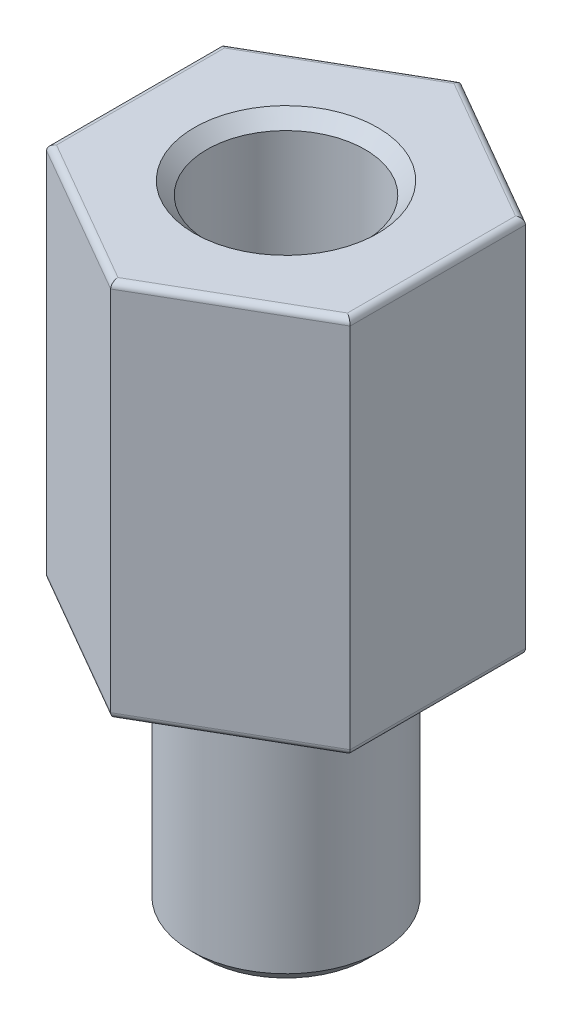
ISO-10303-21;
HEADER;
FILE_DESCRIPTION(('STEP AP214'),'2;1');
FILE_NAME('part.step','',(''),(''),'','','');
FILE_SCHEMA(('AUTOMOTIVE_DESIGN { 1 0 10303 214 1 1 1 1 }'));
ENDSEC;
DATA;
#1=APPLICATION_CONTEXT('core data for automotive mechanical design processes');
#2=APPLICATION_PROTOCOL_DEFINITION('international standard','automotive_design',2000,#1);
#3=PRODUCT_CONTEXT('',#1,'mechanical');
#4=PRODUCT('Part','Part','',(#3));
#5=PRODUCT_RELATED_PRODUCT_CATEGORY('part','',(#4));
#6=PRODUCT_DEFINITION_FORMATION('','',#4);
#7=PRODUCT_DEFINITION_CONTEXT('part definition',#1,'design');
#8=PRODUCT_DEFINITION('design','',#6,#7);
#9=PRODUCT_DEFINITION_SHAPE('','',#8);
#10=(LENGTH_UNIT() NAMED_UNIT(*) SI_UNIT(.MILLI.,.METRE.));
#11=(NAMED_UNIT(*) PLANE_ANGLE_UNIT() SI_UNIT($,.RADIAN.));
#12=(NAMED_UNIT(*) SI_UNIT($,.STERADIAN.) SOLID_ANGLE_UNIT());
#13=UNCERTAINTY_MEASURE_WITH_UNIT(LENGTH_MEASURE(1.E-05),#10,'distance_accuracy_value','');
#14=(GEOMETRIC_REPRESENTATION_CONTEXT(3) GLOBAL_UNCERTAINTY_ASSIGNED_CONTEXT((#13)) GLOBAL_UNIT_ASSIGNED_CONTEXT((#10,
#11,#12)) REPRESENTATION_CONTEXT('',''));
#15=CARTESIAN_POINT('',(0.,0.,0.));
#16=DIRECTION('',(0.,0.,1.));
#17=DIRECTION('',(1.,0.,0.));
#18=AXIS2_PLACEMENT_3D('',#15,#16,#17);
#19=CARTESIAN_POINT('',(0.,4.,0.));
#20=DIRECTION('',(0.,-1.,0.));
#21=DIRECTION('',(0.,0.,-1.));
#22=AXIS2_PLACEMENT_3D('',#19,#20,#21);
#23=CYLINDRICAL_SURFACE('',#22,1.5);
#24=CARTESIAN_POINT('',(0.,0.2,0.));
#25=DIRECTION('',(0.,1.,0.));
#26=DIRECTION('',(0.,0.,1.));
#27=AXIS2_PLACEMENT_3D('',#24,#25,#26);
#28=CIRCLE('',#27,1.5);
#29=CARTESIAN_POINT('',(0.,0.2,1.5));
#30=VERTEX_POINT('',#29);
#31=EDGE_CURVE('E217',#30,#30,#28,.T.);
#32=ORIENTED_EDGE('',*,*,#31,.T.);
#33=EDGE_LOOP('',(#32));
#34=FACE_BOUND('',#33,.T.);
#35=CARTESIAN_POINT('',(0.,4.,0.));
#36=DIRECTION('',(0.,1.,0.));
#37=DIRECTION('',(0.,0.,1.));
#38=AXIS2_PLACEMENT_3D('',#35,#36,#37);
#39=CIRCLE('',#38,1.5);
#40=CARTESIAN_POINT('',(0.,4.,1.5));
#41=VERTEX_POINT('',#40);
#42=EDGE_CURVE('E164',#41,#41,#39,.T.);
#43=ORIENTED_EDGE('',*,*,#42,.F.);
#44=EDGE_LOOP('',(#43));
#45=FACE_BOUND('',#44,.T.);
#46=ADVANCED_FACE('F39',(#34,#45),#23,.T.);
#47=CARTESIAN_POINT('',(0.,0.,0.));
#48=DIRECTION('',(0.,1.,0.));
#49=DIRECTION('',(0.,0.,1.));
#50=AXIS2_PLACEMENT_3D('',#47,#48,#49);
#51=PLANE('',#50);
#52=CARTESIAN_POINT('',(0.,0.,0.));
#53=DIRECTION('',(0.,1.,0.));
#54=DIRECTION('',(0.,0.,1.));
#55=AXIS2_PLACEMENT_3D('',#52,#53,#54);
#56=CIRCLE('',#55,1.3);
#57=CARTESIAN_POINT('',(0.,0.,1.3));
#58=VERTEX_POINT('',#57);
#59=EDGE_CURVE('E248',#58,#58,#56,.F.);
#60=ORIENTED_EDGE('',*,*,#59,.T.);
#61=EDGE_LOOP('',(#60));
#62=FACE_BOUND('',#61,.T.);
#63=ADVANCED_FACE('F263',(#62),#51,.F.);
#64=CARTESIAN_POINT('',(0.,4.,0.));
#65=DIRECTION('',(0.,1.,0.));
#66=DIRECTION('',(0.,0.,1.));
#67=AXIS2_PLACEMENT_3D('',#64,#65,#66);
#68=PLANE('',#67);
#69=DIRECTION('',(-0.866025403784439,0.,-0.5));
#70=VECTOR('',#69,1.);
#71=CARTESIAN_POINT('',(1.15,4.,-1.99185842870421));
#72=LINE('',#71,#70);
#73=CARTESIAN_POINT('',(0.,4.,-2.65581123827228));
#74=VERTEX_POINT('',#73);
#75=CARTESIAN_POINT('',(2.3,4.,-1.32790561913614));
#76=VERTEX_POINT('',#75);
#77=EDGE_CURVE('E172',#74,#76,#72,.F.);
#78=ORIENTED_EDGE('',*,*,#77,.T.);
#79=DIRECTION('',(0.,0.,-1.));
#80=VECTOR('',#79,1.);
#81=CARTESIAN_POINT('',(2.3,4.,0.));
#82=LINE('',#81,#80);
#83=CARTESIAN_POINT('',(2.3,4.,1.32790561913614));
#84=VERTEX_POINT('',#83);
#85=EDGE_CURVE('E182',#76,#84,#82,.F.);
#86=ORIENTED_EDGE('',*,*,#85,.T.);
#87=DIRECTION('',(0.866025403784438,0.,-0.5));
#88=VECTOR('',#87,1.);
#89=CARTESIAN_POINT('',(1.15,4.,1.99185842870421));
#90=LINE('',#89,#88);
#91=CARTESIAN_POINT('',(0.,4.,2.65581123827228));
#92=VERTEX_POINT('',#91);
#93=EDGE_CURVE('E180',#84,#92,#90,.F.);
#94=ORIENTED_EDGE('',*,*,#93,.T.);
#95=DIRECTION('',(0.866025403784439,0.,0.5));
#96=VECTOR('',#95,1.);
#97=CARTESIAN_POINT('',(-1.15,4.,1.99185842870421));
#98=LINE('',#97,#96);
#99=CARTESIAN_POINT('',(-2.3,4.,1.32790561913614));
#100=VERTEX_POINT('',#99);
#101=EDGE_CURVE('E178',#92,#100,#98,.F.);
#102=ORIENTED_EDGE('',*,*,#101,.T.);
#103=DIRECTION('',(0.,0.,1.));
#104=VECTOR('',#103,1.);
#105=CARTESIAN_POINT('',(-2.3,4.,0.));
#106=LINE('',#105,#104);
#107=CARTESIAN_POINT('',(-2.3,4.,-1.32790561913614));
#108=VERTEX_POINT('',#107);
#109=EDGE_CURVE('E176',#100,#108,#106,.F.);
#110=ORIENTED_EDGE('',*,*,#109,.T.);
#111=DIRECTION('',(-0.866025403784439,0.,0.5));
#112=VECTOR('',#111,1.);
#113=CARTESIAN_POINT('',(-1.15,4.,-1.99185842870421));
#114=LINE('',#113,#112);
#115=EDGE_CURVE('E174',#108,#74,#114,.F.);
#116=ORIENTED_EDGE('',*,*,#115,.T.);
#117=EDGE_LOOP('',(#78,#86,#94,#102,#110,#116));
#118=FACE_BOUND('',#117,.T.);
#119=ORIENTED_EDGE('',*,*,#42,.T.);
#120=EDGE_LOOP('',(#119));
#121=FACE_BOUND('',#120,.T.);
#122=ADVANCED_FACE('F269',(#118,#121),#68,.F.);
#123=CARTESIAN_POINT('',(0.,10.,-2.7712812921102));
#124=DIRECTION('',(0.5,0.,0.866025403784439));
#125=DIRECTION('',(0.866025403784439,0.,-0.5));
#126=AXIS2_PLACEMENT_3D('',#123,#124,#125);
#127=PLANE('',#126);
#128=DIRECTION('',(0.,-1.,0.));
#129=VECTOR('',#128,1.);
#130=CARTESIAN_POINT('',(0.,10.,-2.7712812921102));
#131=LINE('',#130,#129);
#132=CARTESIAN_POINT('',(0.,9.9,-2.7712812921102));
#133=VERTEX_POINT('',#132);
#134=CARTESIAN_POINT('',(0.,4.1,-2.7712812921102));
#135=VERTEX_POINT('',#134);
#136=EDGE_CURVE('E145',#133,#135,#131,.T.);
#137=ORIENTED_EDGE('',*,*,#136,.T.);
#138=DIRECTION('',(-0.866025403784439,0.,0.5));
#139=VECTOR('',#138,1.);
#140=CARTESIAN_POINT('',(0.,4.1,-2.7712812921102));
#141=LINE('',#140,#139);
#142=CARTESIAN_POINT('',(-2.4,4.1,-1.3856406460551));
#143=VERTEX_POINT('',#142);
#144=EDGE_CURVE('E200',#135,#143,#141,.T.);
#145=ORIENTED_EDGE('',*,*,#144,.T.);
#146=DIRECTION('',(0.,-1.,0.));
#147=VECTOR('',#146,1.);
#148=CARTESIAN_POINT('',(-2.4,10.,-1.3856406460551));
#149=LINE('',#148,#147);
#150=CARTESIAN_POINT('',(-2.4,9.9,-1.3856406460551));
#151=VERTEX_POINT('',#150);
#152=EDGE_CURVE('E161',#151,#143,#149,.T.);
#153=ORIENTED_EDGE('',*,*,#152,.F.);
#154=DIRECTION('',(-0.866025403784439,0.,0.5));
#155=VECTOR('',#154,1.);
#156=CARTESIAN_POINT('',(0.,9.9,-2.7712812921102));
#157=LINE('',#156,#155);
#158=EDGE_CURVE('E197',#151,#133,#157,.F.);
#159=ORIENTED_EDGE('',*,*,#158,.T.);
#160=EDGE_LOOP('',(#137,#145,#153,#159));
#161=FACE_BOUND('',#160,.T.);
#162=ADVANCED_FACE('F368',(#161),#127,.F.);
#163=CARTESIAN_POINT('',(-2.4,10.,-1.3856406460551));
#164=DIRECTION('',(1.,0.,0.));
#165=DIRECTION('',(0.,0.,-1.));
#166=AXIS2_PLACEMENT_3D('',#163,#164,#165);
#167=PLANE('',#166);
#168=ORIENTED_EDGE('',*,*,#152,.T.);
#169=DIRECTION('',(0.,0.,1.));
#170=VECTOR('',#169,1.);
#171=CARTESIAN_POINT('',(-2.4,4.1,-1.3856406460551));
#172=LINE('',#171,#170);
#173=CARTESIAN_POINT('',(-2.4,4.1,1.3856406460551));
#174=VERTEX_POINT('',#173);
#175=EDGE_CURVE('E195',#143,#174,#172,.T.);
#176=ORIENTED_EDGE('',*,*,#175,.T.);
#177=DIRECTION('',(0.,-1.,0.));
#178=VECTOR('',#177,1.);
#179=CARTESIAN_POINT('',(-2.4,10.,1.3856406460551));
#180=LINE('',#179,#178);
#181=CARTESIAN_POINT('',(-2.4,9.9,1.3856406460551));
#182=VERTEX_POINT('',#181);
#183=EDGE_CURVE('E158',#182,#174,#180,.T.);
#184=ORIENTED_EDGE('',*,*,#183,.F.);
#185=DIRECTION('',(0.,0.,1.));
#186=VECTOR('',#185,1.);
#187=CARTESIAN_POINT('',(-2.4,9.9,-1.3856406460551));
#188=LINE('',#187,#186);
#189=EDGE_CURVE('E193',#182,#151,#188,.F.);
#190=ORIENTED_EDGE('',*,*,#189,.T.);
#191=EDGE_LOOP('',(#168,#176,#184,#190));
#192=FACE_BOUND('',#191,.T.);
#193=ADVANCED_FACE('F336',(#192),#167,.F.);
#194=CARTESIAN_POINT('',(-2.4,10.,1.3856406460551));
#195=DIRECTION('',(0.5,0.,-0.866025403784439));
#196=DIRECTION('',(-0.866025403784439,0.,-0.5));
#197=AXIS2_PLACEMENT_3D('',#194,#195,#196);
#198=PLANE('',#197);
#199=ORIENTED_EDGE('',*,*,#183,.T.);
#200=DIRECTION('',(0.866025403784439,0.,0.5));
#201=VECTOR('',#200,1.);
#202=CARTESIAN_POINT('',(-2.4,4.1,1.3856406460551));
#203=LINE('',#202,#201);
#204=CARTESIAN_POINT('',(0.,4.1,2.7712812921102));
#205=VERTEX_POINT('',#204);
#206=EDGE_CURVE('E191',#174,#205,#203,.T.);
#207=ORIENTED_EDGE('',*,*,#206,.T.);
#208=DIRECTION('',(0.,-1.,0.));
#209=VECTOR('',#208,1.);
#210=CARTESIAN_POINT('',(0.,10.,2.7712812921102));
#211=LINE('',#210,#209);
#212=CARTESIAN_POINT('',(0.,9.9,2.7712812921102));
#213=VERTEX_POINT('',#212);
#214=EDGE_CURVE('E155',#213,#205,#211,.T.);
#215=ORIENTED_EDGE('',*,*,#214,.F.);
#216=DIRECTION('',(0.866025403784439,0.,0.5));
#217=VECTOR('',#216,1.);
#218=CARTESIAN_POINT('',(-2.4,9.9,1.3856406460551));
#219=LINE('',#218,#217);
#220=EDGE_CURVE('E189',#213,#182,#219,.F.);
#221=ORIENTED_EDGE('',*,*,#220,.T.);
#222=EDGE_LOOP('',(#199,#207,#215,#221));
#223=FACE_BOUND('',#222,.T.);
#224=ADVANCED_FACE('F333',(#223),#198,.F.);
#225=CARTESIAN_POINT('',(0.,10.,2.7712812921102));
#226=DIRECTION('',(-0.5,0.,-0.866025403784438));
#227=DIRECTION('',(-0.866025403784438,0.,0.5));
#228=AXIS2_PLACEMENT_3D('',#225,#226,#227);
#229=PLANE('',#228);
#230=ORIENTED_EDGE('',*,*,#214,.T.);
#231=DIRECTION('',(0.866025403784438,0.,-0.5));
#232=VECTOR('',#231,1.);
#233=CARTESIAN_POINT('',(0.,4.1,2.7712812921102));
#234=LINE('',#233,#232);
#235=CARTESIAN_POINT('',(2.4,4.1,1.3856406460551));
#236=VERTEX_POINT('',#235);
#237=EDGE_CURVE('E187',#205,#236,#234,.T.);
#238=ORIENTED_EDGE('',*,*,#237,.T.);
#239=DIRECTION('',(0.,-1.,0.));
#240=VECTOR('',#239,1.);
#241=CARTESIAN_POINT('',(2.4,10.,1.3856406460551));
#242=LINE('',#241,#240);
#243=CARTESIAN_POINT('',(2.4,9.9,1.3856406460551));
#244=VERTEX_POINT('',#243);
#245=EDGE_CURVE('E152',#244,#236,#242,.T.);
#246=ORIENTED_EDGE('',*,*,#245,.F.);
#247=DIRECTION('',(0.866025403784438,0.,-0.5));
#248=VECTOR('',#247,1.);
#249=CARTESIAN_POINT('',(0.,9.9,2.7712812921102));
#250=LINE('',#249,#248);
#251=EDGE_CURVE('E185',#244,#213,#250,.F.);
#252=ORIENTED_EDGE('',*,*,#251,.T.);
#253=EDGE_LOOP('',(#230,#238,#246,#252));
#254=FACE_BOUND('',#253,.T.);
#255=ADVANCED_FACE('F353',(#254),#229,.F.);
#256=CARTESIAN_POINT('',(2.4,10.,1.3856406460551));
#257=DIRECTION('',(-1.,0.,0.));
#258=DIRECTION('',(0.,0.,1.));
#259=AXIS2_PLACEMENT_3D('',#256,#257,#258);
#260=PLANE('',#259);
#261=ORIENTED_EDGE('',*,*,#245,.T.);
#262=DIRECTION('',(0.,0.,-1.));
#263=VECTOR('',#262,1.);
#264=CARTESIAN_POINT('',(2.4,4.1,1.3856406460551));
#265=LINE('',#264,#263);
#266=CARTESIAN_POINT('',(2.4,4.1,-1.3856406460551));
#267=VERTEX_POINT('',#266);
#268=EDGE_CURVE('E169',#236,#267,#265,.T.);
#269=ORIENTED_EDGE('',*,*,#268,.T.);
#270=DIRECTION('',(0.,-1.,0.));
#271=VECTOR('',#270,1.);
#272=CARTESIAN_POINT('',(2.4,10.,-1.3856406460551));
#273=LINE('',#272,#271);
#274=CARTESIAN_POINT('',(2.4,9.9,-1.3856406460551));
#275=VERTEX_POINT('',#274);
#276=EDGE_CURVE('E148',#275,#267,#273,.T.);
#277=ORIENTED_EDGE('',*,*,#276,.F.);
#278=DIRECTION('',(0.,0.,-1.));
#279=VECTOR('',#278,1.);
#280=CARTESIAN_POINT('',(2.4,9.9,1.3856406460551));
#281=LINE('',#280,#279);
#282=EDGE_CURVE('E167',#275,#244,#281,.F.);
#283=ORIENTED_EDGE('',*,*,#282,.T.);
#284=EDGE_LOOP('',(#261,#269,#277,#283));
#285=FACE_BOUND('',#284,.T.);
#286=ADVANCED_FACE('F357',(#285),#260,.F.);
#287=CARTESIAN_POINT('',(2.4,10.,-1.3856406460551));
#288=DIRECTION('',(-0.5,0.,0.866025403784439));
#289=DIRECTION('',(0.866025403784439,0.,0.5));
#290=AXIS2_PLACEMENT_3D('',#287,#288,#289);
#291=PLANE('',#290);
#292=ORIENTED_EDGE('',*,*,#276,.T.);
#293=DIRECTION('',(-0.866025403784439,0.,-0.5));
#294=VECTOR('',#293,1.);
#295=CARTESIAN_POINT('',(2.4,4.1,-1.3856406460551));
#296=LINE('',#295,#294);
#297=EDGE_CURVE('E204',#267,#135,#296,.T.);
#298=ORIENTED_EDGE('',*,*,#297,.T.);
#299=ORIENTED_EDGE('',*,*,#136,.F.);
#300=DIRECTION('',(-0.866025403784439,0.,-0.5));
#301=VECTOR('',#300,1.);
#302=CARTESIAN_POINT('',(2.4,9.9,-1.3856406460551));
#303=LINE('',#302,#301);
#304=EDGE_CURVE('E202',#133,#275,#303,.F.);
#305=ORIENTED_EDGE('',*,*,#304,.T.);
#306=EDGE_LOOP('',(#292,#298,#299,#305));
#307=FACE_BOUND('',#306,.T.);
#308=ADVANCED_FACE('F366',(#307),#291,.F.);
#309=CARTESIAN_POINT('',(0.,10.,0.));
#310=DIRECTION('',(0.,1.,0.));
#311=DIRECTION('',(0.,0.,1.));
#312=AXIS2_PLACEMENT_3D('',#309,#310,#311);
#313=PLANE('',#312);
#314=CARTESIAN_POINT('',(0.,10.,0.));
#315=DIRECTION('',(0.,1.,0.));
#316=DIRECTION('',(0.,0.,1.));
#317=AXIS2_PLACEMENT_3D('',#314,#315,#316);
#318=CIRCLE('',#317,1.45);
#319=CARTESIAN_POINT('',(0.,10.,1.45));
#320=VERTEX_POINT('',#319);
#321=EDGE_CURVE('E11',#320,#320,#318,.F.);
#322=ORIENTED_EDGE('',*,*,#321,.T.);
#323=EDGE_LOOP('',(#322));
#324=FACE_BOUND('',#323,.T.);
#325=DIRECTION('',(-0.866025403784439,0.,-0.5));
#326=VECTOR('',#325,1.);
#327=CARTESIAN_POINT('',(-0.0500000000000006,10.,-2.68467875173176));
#328=LINE('',#327,#326);
#329=CARTESIAN_POINT('',(2.3,10.,-1.32790561913614));
#330=VERTEX_POINT('',#329);
#331=CARTESIAN_POINT('',(0.,10.,-2.65581123827228));
#332=VERTEX_POINT('',#331);
#333=EDGE_CURVE('E206',#330,#332,#328,.T.);
#334=ORIENTED_EDGE('',*,*,#333,.T.);
#335=DIRECTION('',(-0.866025403784439,0.,0.5));
#336=VECTOR('',#335,1.);
#337=CARTESIAN_POINT('',(-2.35,10.,-1.29903810567666));
#338=LINE('',#337,#336);
#339=CARTESIAN_POINT('',(-2.3,10.,-1.32790561913614));
#340=VERTEX_POINT('',#339);
#341=EDGE_CURVE('E215',#332,#340,#338,.T.);
#342=ORIENTED_EDGE('',*,*,#341,.T.);
#343=DIRECTION('',(0.,0.,1.));
#344=VECTOR('',#343,1.);
#345=CARTESIAN_POINT('',(-2.3,10.,1.3856406460551));
#346=LINE('',#345,#344);
#347=CARTESIAN_POINT('',(-2.3,10.,1.32790561913614));
#348=VERTEX_POINT('',#347);
#349=EDGE_CURVE('E61',#340,#348,#346,.T.);
#350=ORIENTED_EDGE('',*,*,#349,.T.);
#351=DIRECTION('',(0.866025403784439,0.,0.5));
#352=VECTOR('',#351,1.);
#353=CARTESIAN_POINT('',(0.0500000000000006,10.,2.68467875173176));
#354=LINE('',#353,#352);
#355=CARTESIAN_POINT('',(0.,10.,2.65581123827228));
#356=VERTEX_POINT('',#355);
#357=EDGE_CURVE('E212',#348,#356,#354,.T.);
#358=ORIENTED_EDGE('',*,*,#357,.T.);
#359=DIRECTION('',(0.866025403784438,0.,-0.5));
#360=VECTOR('',#359,1.);
#361=CARTESIAN_POINT('',(2.35,10.,1.29903810567666));
#362=LINE('',#361,#360);
#363=CARTESIAN_POINT('',(2.3,10.,1.32790561913614));
#364=VERTEX_POINT('',#363);
#365=EDGE_CURVE('E210',#356,#364,#362,.T.);
#366=ORIENTED_EDGE('',*,*,#365,.T.);
#367=DIRECTION('',(0.,0.,-1.));
#368=VECTOR('',#367,1.);
#369=CARTESIAN_POINT('',(2.3,10.,-1.3856406460551));
#370=LINE('',#369,#368);
#371=EDGE_CURVE('E208',#364,#330,#370,.T.);
#372=ORIENTED_EDGE('',*,*,#371,.T.);
#373=EDGE_LOOP('',(#334,#342,#350,#358,#366,#372));
#374=FACE_BOUND('',#373,.T.);
#375=ADVANCED_FACE('F299',(#324,#374),#313,.T.);
#376=CARTESIAN_POINT('',(-2.3,4.1,-1.3856406460551));
#377=DIRECTION('',(0.,0.,1.));
#378=DIRECTION('',(1.,0.,0.));
#379=AXIS2_PLACEMENT_3D('',#376,#377,#378);
#380=CYLINDRICAL_SURFACE('',#379,0.1);
#381=CARTESIAN_POINT('',(-2.3,4.1,-1.32790561913614));
#382=DIRECTION('',(-0.5,0.,0.866025403784439));
#383=DIRECTION('',(-0.866025403784439,0.,-0.5));
#384=AXIS2_PLACEMENT_3D('',#381,#382,#383);
#385=ELLIPSE('',#384,0.115470053837925,0.1);
#386=EDGE_CURVE('E229',#108,#143,#385,.F.);
#387=ORIENTED_EDGE('',*,*,#386,.F.);
#388=ORIENTED_EDGE('',*,*,#109,.F.);
#389=CARTESIAN_POINT('',(-2.3,4.1,1.32790561913614));
#390=DIRECTION('',(0.5,0.,0.866025403784439));
#391=DIRECTION('',(-0.866025403784439,0.,0.5));
#392=AXIS2_PLACEMENT_3D('',#389,#390,#391);
#393=ELLIPSE('',#392,0.115470053837925,0.1);
#394=EDGE_CURVE('E149',#174,#100,#393,.T.);
#395=ORIENTED_EDGE('',*,*,#394,.F.);
#396=ORIENTED_EDGE('',*,*,#175,.F.);
#397=EDGE_LOOP('',(#387,#388,#395,#396));
#398=FACE_BOUND('',#397,.T.);
#399=ADVANCED_FACE('F295',(#398),#380,.T.);
#400=CARTESIAN_POINT('',(-2.35,4.1,1.29903810567666));
#401=DIRECTION('',(0.866025403784439,0.,0.5));
#402=DIRECTION('',(0.5,0.,-0.866025403784439));
#403=AXIS2_PLACEMENT_3D('',#400,#401,#402);
#404=CYLINDRICAL_SURFACE('',#403,0.1);
#405=ORIENTED_EDGE('',*,*,#394,.T.);
#406=ORIENTED_EDGE('',*,*,#101,.F.);
#407=CARTESIAN_POINT('',(0.,4.1,2.65581123827228));
#408=DIRECTION('',(1.,0.,0.));
#409=DIRECTION('',(0.,0.,1.));
#410=AXIS2_PLACEMENT_3D('',#407,#408,#409);
#411=ELLIPSE('',#410,0.115470053837925,0.1);
#412=EDGE_CURVE('E226',#205,#92,#411,.T.);
#413=ORIENTED_EDGE('',*,*,#412,.F.);
#414=ORIENTED_EDGE('',*,*,#206,.F.);
#415=EDGE_LOOP('',(#405,#406,#413,#414));
#416=FACE_BOUND('',#415,.T.);
#417=ADVANCED_FACE('F291',(#416),#404,.T.);
#418=CARTESIAN_POINT('',(0.05,4.1,-2.68467875173176));
#419=DIRECTION('',(-0.866025403784439,0.,0.5));
#420=DIRECTION('',(0.5,0.,0.866025403784439));
#421=AXIS2_PLACEMENT_3D('',#418,#419,#420);
#422=CYLINDRICAL_SURFACE('',#421,0.1);
#423=ORIENTED_EDGE('',*,*,#386,.T.);
#424=ORIENTED_EDGE('',*,*,#144,.F.);
#425=CARTESIAN_POINT('',(0.,4.1,-2.65581123827228));
#426=DIRECTION('',(-1.,0.,0.));
#427=DIRECTION('',(0.,0.,-1.));
#428=AXIS2_PLACEMENT_3D('',#425,#426,#427);
#429=ELLIPSE('',#428,0.115470053837925,0.1);
#430=EDGE_CURVE('E223',#74,#135,#429,.F.);
#431=ORIENTED_EDGE('',*,*,#430,.F.);
#432=ORIENTED_EDGE('',*,*,#115,.F.);
#433=EDGE_LOOP('',(#423,#424,#431,#432));
#434=FACE_BOUND('',#433,.T.);
#435=ADVANCED_FACE('F287',(#434),#422,.T.);
#436=CARTESIAN_POINT('',(-0.0500000000000001,4.1,2.68467875173176));
#437=DIRECTION('',(0.866025403784438,0.,-0.5));
#438=DIRECTION('',(-0.5,0.,-0.866025403784438));
#439=AXIS2_PLACEMENT_3D('',#436,#437,#438);
#440=CYLINDRICAL_SURFACE('',#439,0.1);
#441=ORIENTED_EDGE('',*,*,#412,.T.);
#442=ORIENTED_EDGE('',*,*,#93,.F.);
#443=CARTESIAN_POINT('',(2.3,4.1,1.32790561913614));
#444=DIRECTION('',(0.5,0.,-0.866025403784439));
#445=DIRECTION('',(0.866025403784439,0.,0.5));
#446=AXIS2_PLACEMENT_3D('',#443,#444,#445);
#447=ELLIPSE('',#446,0.115470053837925,0.1);
#448=EDGE_CURVE('E220',#236,#84,#447,.T.);
#449=ORIENTED_EDGE('',*,*,#448,.F.);
#450=ORIENTED_EDGE('',*,*,#237,.F.);
#451=EDGE_LOOP('',(#441,#442,#449,#450));
#452=FACE_BOUND('',#451,.T.);
#453=ADVANCED_FACE('F283',(#452),#440,.T.);
#454=CARTESIAN_POINT('',(2.35,4.1,-1.29903810567666));
#455=DIRECTION('',(-0.866025403784439,0.,-0.5));
#456=DIRECTION('',(-0.5,0.,0.866025403784439));
#457=AXIS2_PLACEMENT_3D('',#454,#455,#456);
#458=CYLINDRICAL_SURFACE('',#457,0.1);
#459=ORIENTED_EDGE('',*,*,#430,.T.);
#460=ORIENTED_EDGE('',*,*,#297,.F.);
#461=CARTESIAN_POINT('',(2.3,4.1,-1.32790561913614));
#462=DIRECTION('',(-0.5,0.,-0.866025403784438));
#463=DIRECTION('',(-0.866025403784439,0.,0.5));
#464=AXIS2_PLACEMENT_3D('',#461,#462,#463);
#465=ELLIPSE('',#464,0.115470053837925,0.1);
#466=EDGE_CURVE('E218',#76,#267,#465,.F.);
#467=ORIENTED_EDGE('',*,*,#466,.F.);
#468=ORIENTED_EDGE('',*,*,#77,.F.);
#469=EDGE_LOOP('',(#459,#460,#467,#468));
#470=FACE_BOUND('',#469,.T.);
#471=ADVANCED_FACE('F279',(#470),#458,.T.);
#472=CARTESIAN_POINT('',(2.3,4.1,1.3856406460551));
#473=DIRECTION('',(0.,0.,-1.));
#474=DIRECTION('',(-1.,0.,0.));
#475=AXIS2_PLACEMENT_3D('',#472,#473,#474);
#476=CYLINDRICAL_SURFACE('',#475,0.1);
#477=ORIENTED_EDGE('',*,*,#448,.T.);
#478=ORIENTED_EDGE('',*,*,#85,.F.);
#479=ORIENTED_EDGE('',*,*,#466,.T.);
#480=ORIENTED_EDGE('',*,*,#268,.F.);
#481=EDGE_LOOP('',(#477,#478,#479,#480));
#482=FACE_BOUND('',#481,.T.);
#483=ADVANCED_FACE('F275',(#482),#476,.T.);
#484=CARTESIAN_POINT('',(1.15,9.9,1.99185842870421));
#485=DIRECTION('',(-0.866025403784438,0.,0.5));
#486=DIRECTION('',(0.5,0.,0.866025403784438));
#487=AXIS2_PLACEMENT_3D('',#484,#485,#486);
#488=CYLINDRICAL_SURFACE('',#487,0.1);
#489=CARTESIAN_POINT('',(0.,9.9,2.65581123827228));
#490=DIRECTION('',(-1.,0.,0.));
#491=DIRECTION('',(0.,0.,1.));
#492=AXIS2_PLACEMENT_3D('',#489,#490,#491);
#493=ELLIPSE('',#492,0.115470053837925,0.1);
#494=EDGE_CURVE('E241',#213,#356,#493,.T.);
#495=ORIENTED_EDGE('',*,*,#494,.F.);
#496=ORIENTED_EDGE('',*,*,#251,.F.);
#497=CARTESIAN_POINT('',(2.3,9.9,1.32790561913614));
#498=DIRECTION('',(-0.5,0.,0.866025403784439));
#499=DIRECTION('',(0.866025403784439,0.,0.5));
#500=AXIS2_PLACEMENT_3D('',#497,#498,#499);
#501=ELLIPSE('',#500,0.115470053837925,0.1);
#502=EDGE_CURVE('E221',#364,#244,#501,.F.);
#503=ORIENTED_EDGE('',*,*,#502,.F.);
#504=ORIENTED_EDGE('',*,*,#365,.F.);
#505=EDGE_LOOP('',(#495,#496,#503,#504));
#506=FACE_BOUND('',#505,.T.);
#507=ADVANCED_FACE('F278',(#506),#488,.T.);
#508=CARTESIAN_POINT('',(2.3,9.9,0.));
#509=DIRECTION('',(0.,0.,1.));
#510=DIRECTION('',(1.,0.,0.));
#511=AXIS2_PLACEMENT_3D('',#508,#509,#510);
#512=CYLINDRICAL_SURFACE('',#511,0.1);
#513=ORIENTED_EDGE('',*,*,#502,.T.);
#514=ORIENTED_EDGE('',*,*,#282,.F.);
#515=CARTESIAN_POINT('',(2.3,9.9,-1.32790561913614));
#516=DIRECTION('',(0.5,0.,0.866025403784438));
#517=DIRECTION('',(0.866025403784439,0.,-0.5));
#518=AXIS2_PLACEMENT_3D('',#515,#516,#517);
#519=ELLIPSE('',#518,0.115470053837925,0.1);
#520=EDGE_CURVE('E238',#330,#275,#519,.F.);
#521=ORIENTED_EDGE('',*,*,#520,.F.);
#522=ORIENTED_EDGE('',*,*,#371,.F.);
#523=EDGE_LOOP('',(#513,#514,#521,#522));
#524=FACE_BOUND('',#523,.T.);
#525=ADVANCED_FACE('F314',(#524),#512,.T.);
#526=CARTESIAN_POINT('',(-1.15,9.9,1.99185842870421));
#527=DIRECTION('',(-0.866025403784439,0.,-0.5));
#528=DIRECTION('',(-0.5,0.,0.866025403784439));
#529=AXIS2_PLACEMENT_3D('',#526,#527,#528);
#530=CYLINDRICAL_SURFACE('',#529,0.1);
#531=ORIENTED_EDGE('',*,*,#494,.T.);
#532=ORIENTED_EDGE('',*,*,#357,.F.);
#533=CARTESIAN_POINT('',(-2.3,9.9,1.32790561913614));
#534=DIRECTION('',(-0.5,0.,-0.866025403784439));
#535=DIRECTION('',(-0.866025403784439,0.,0.5));
#536=AXIS2_PLACEMENT_3D('',#533,#534,#535);
#537=ELLIPSE('',#536,0.115470053837925,0.1);
#538=EDGE_CURVE('E235',#182,#348,#537,.T.);
#539=ORIENTED_EDGE('',*,*,#538,.F.);
#540=ORIENTED_EDGE('',*,*,#220,.F.);
#541=EDGE_LOOP('',(#531,#532,#539,#540));
#542=FACE_BOUND('',#541,.T.);
#543=ADVANCED_FACE('F310',(#542),#530,.T.);
#544=CARTESIAN_POINT('',(1.15,9.9,-1.99185842870421));
#545=DIRECTION('',(0.866025403784439,0.,0.5));
#546=DIRECTION('',(0.5,0.,-0.866025403784439));
#547=AXIS2_PLACEMENT_3D('',#544,#545,#546);
#548=CYLINDRICAL_SURFACE('',#547,0.1);
#549=ORIENTED_EDGE('',*,*,#520,.T.);
#550=ORIENTED_EDGE('',*,*,#304,.F.);
#551=CARTESIAN_POINT('',(0.,9.9,-2.65581123827228));
#552=DIRECTION('',(1.,0.,0.));
#553=DIRECTION('',(0.,0.,1.));
#554=AXIS2_PLACEMENT_3D('',#551,#552,#553);
#555=ELLIPSE('',#554,0.115470053837925,0.1);
#556=EDGE_CURVE('E142',#332,#133,#555,.F.);
#557=ORIENTED_EDGE('',*,*,#556,.F.);
#558=ORIENTED_EDGE('',*,*,#333,.F.);
#559=EDGE_LOOP('',(#549,#550,#557,#558));
#560=FACE_BOUND('',#559,.T.);
#561=ADVANCED_FACE('F306',(#560),#548,.T.);
#562=CARTESIAN_POINT('',(-2.3,9.9,0.));
#563=DIRECTION('',(0.,0.,-1.));
#564=DIRECTION('',(-1.,0.,0.));
#565=AXIS2_PLACEMENT_3D('',#562,#563,#564);
#566=CYLINDRICAL_SURFACE('',#565,0.1);
#567=ORIENTED_EDGE('',*,*,#538,.T.);
#568=ORIENTED_EDGE('',*,*,#349,.F.);
#569=CARTESIAN_POINT('',(-2.3,9.9,-1.32790561913614));
#570=DIRECTION('',(0.5,0.,-0.866025403784439));
#571=DIRECTION('',(-0.866025403784439,0.,-0.5));
#572=AXIS2_PLACEMENT_3D('',#569,#570,#571);
#573=ELLIPSE('',#572,0.115470053837925,0.1);
#574=EDGE_CURVE('E54',#151,#340,#573,.T.);
#575=ORIENTED_EDGE('',*,*,#574,.F.);
#576=ORIENTED_EDGE('',*,*,#189,.F.);
#577=EDGE_LOOP('',(#567,#568,#575,#576));
#578=FACE_BOUND('',#577,.T.);
#579=ADVANCED_FACE('F303',(#578),#566,.T.);
#580=CARTESIAN_POINT('',(-1.15,9.9,-1.99185842870421));
#581=DIRECTION('',(0.866025403784439,0.,-0.5));
#582=DIRECTION('',(-0.5,0.,-0.866025403784439));
#583=AXIS2_PLACEMENT_3D('',#580,#581,#582);
#584=CYLINDRICAL_SURFACE('',#583,0.1);
#585=ORIENTED_EDGE('',*,*,#556,.T.);
#586=ORIENTED_EDGE('',*,*,#158,.F.);
#587=ORIENTED_EDGE('',*,*,#574,.T.);
#588=ORIENTED_EDGE('',*,*,#341,.F.);
#589=EDGE_LOOP('',(#585,#586,#587,#588));
#590=FACE_BOUND('',#589,.T.);
#591=ADVANCED_FACE('F135',(#590),#584,.T.);
#592=CARTESIAN_POINT('',(0.,5.,0.));
#593=DIRECTION('',(0.,1.,0.));
#594=DIRECTION('',(0.,0.,1.));
#595=AXIS2_PLACEMENT_3D('',#592,#593,#594);
#596=CONICAL_SURFACE('',#595,1.25,1.02974425867665);
#597=CARTESIAN_POINT('',(0.,4.24892422621555,0.));
#598=VERTEX_POINT('',#597);
#599=VERTEX_LOOP('',#598);
#600=FACE_BOUND('',#599,.T.);
#601=CARTESIAN_POINT('',(0.,5.,0.));
#602=DIRECTION('',(0.,1.,0.));
#603=DIRECTION('',(0.,0.,1.));
#604=AXIS2_PLACEMENT_3D('',#601,#602,#603);
#605=CIRCLE('',#604,1.25);
#606=CARTESIAN_POINT('',(0.,5.,1.25));
#607=VERTEX_POINT('',#606);
#608=EDGE_CURVE('E139',#607,#607,#605,.T.);
#609=ORIENTED_EDGE('',*,*,#608,.T.);
#610=EDGE_LOOP('',(#609));
#611=FACE_BOUND('',#610,.T.);
#612=ADVANCED_FACE('F131',(#600,#611),#596,.F.);
#613=CARTESIAN_POINT('',(0.,10.,0.));
#614=DIRECTION('',(0.,1.,0.));
#615=DIRECTION('',(0.,0.,1.));
#616=AXIS2_PLACEMENT_3D('',#613,#614,#615);
#617=CYLINDRICAL_SURFACE('',#616,1.25);
#618=CARTESIAN_POINT('',(0.,9.8,0.));
#619=DIRECTION('',(0.,1.,0.));
#620=DIRECTION('',(0.,0.,1.));
#621=AXIS2_PLACEMENT_3D('',#618,#619,#620);
#622=CIRCLE('',#621,1.25);
#623=CARTESIAN_POINT('',(0.,9.8,1.25));
#624=VERTEX_POINT('',#623);
#625=EDGE_CURVE('E47',#624,#624,#622,.T.);
#626=ORIENTED_EDGE('',*,*,#625,.T.);
#627=EDGE_LOOP('',(#626));
#628=FACE_BOUND('',#627,.T.);
#629=ORIENTED_EDGE('',*,*,#608,.F.);
#630=EDGE_LOOP('',(#629));
#631=FACE_BOUND('',#630,.T.);
#632=ADVANCED_FACE('F134',(#628,#631),#617,.F.);
#633=CARTESIAN_POINT('',(0.,0.2,0.));
#634=DIRECTION('',(0.,1.,0.));
#635=DIRECTION('',(0.,0.,1.));
#636=AXIS2_PLACEMENT_3D('',#633,#634,#635);
#637=CONICAL_SURFACE('',#636,1.5,0.785398163397448);
#638=ORIENTED_EDGE('',*,*,#59,.F.);
#639=EDGE_LOOP('',(#638));
#640=FACE_BOUND('',#639,.T.);
#641=ORIENTED_EDGE('',*,*,#31,.F.);
#642=EDGE_LOOP('',(#641));
#643=FACE_BOUND('',#642,.T.);
#644=ADVANCED_FACE('F255',(#640,#643),#637,.T.);
#645=CARTESIAN_POINT('',(0.,9.8,0.));
#646=DIRECTION('',(0.,1.,0.));
#647=DIRECTION('',(0.,0.,1.));
#648=AXIS2_PLACEMENT_3D('',#645,#646,#647);
#649=CONICAL_SURFACE('',#648,1.25,0.785398163397449);
#650=ORIENTED_EDGE('',*,*,#321,.F.);
#651=EDGE_LOOP('',(#650));
#652=FACE_BOUND('',#651,.T.);
#653=ORIENTED_EDGE('',*,*,#625,.F.);
#654=EDGE_LOOP('',(#653));
#655=FACE_BOUND('',#654,.T.);
#656=ADVANCED_FACE('F41',(#652,#655),#649,.F.);
#657=CLOSED_SHELL('',(#46,#63,#122,#162,#193,#224,#255,#286,#308,#375,#399,#417,#435,#453,#471,
#483,#507,#525,#543,#561,#579,#591,#612,#632,#644,#656));
#658=MANIFOLD_SOLID_BREP('B2',#657);
#659=ADVANCED_BREP_SHAPE_REPRESENTATION('',(#18,#658),#14);
#660=SHAPE_DEFINITION_REPRESENTATION(#9,#659);
ENDSEC;
END-ISO-10303-21;
